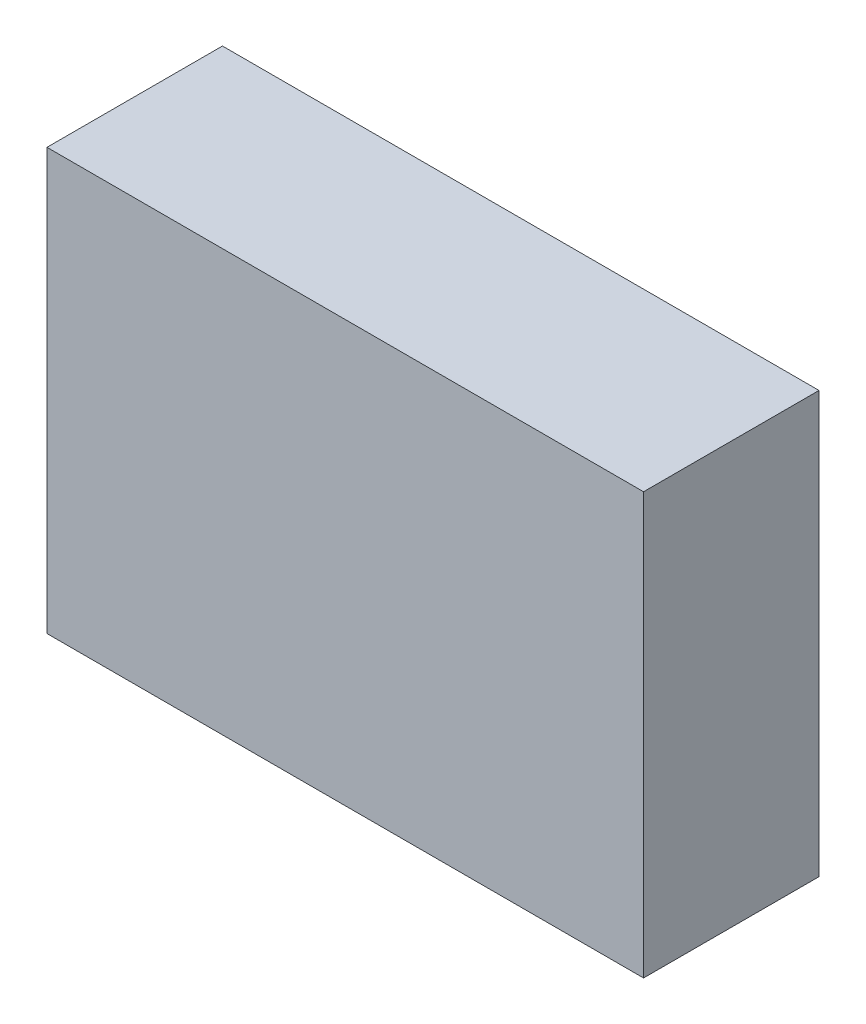
ISO-10303-21;
HEADER;
FILE_DESCRIPTION(('STEP AP214'),'2;1');
FILE_NAME('part.step','',(''),(''),'','','');
FILE_SCHEMA(('AUTOMOTIVE_DESIGN { 1 0 10303 214 1 1 1 1 }'));
ENDSEC;
DATA;
#1=APPLICATION_CONTEXT('core data for automotive mechanical design processes');
#2=APPLICATION_PROTOCOL_DEFINITION('international standard','automotive_design',2000,#1);
#3=PRODUCT_CONTEXT('',#1,'mechanical');
#4=PRODUCT('Part','Part','',(#3));
#5=PRODUCT_RELATED_PRODUCT_CATEGORY('part','',(#4));
#6=PRODUCT_DEFINITION_FORMATION('','',#4);
#7=PRODUCT_DEFINITION_CONTEXT('part definition',#1,'design');
#8=PRODUCT_DEFINITION('design','',#6,#7);
#9=PRODUCT_DEFINITION_SHAPE('','',#8);
#10=(LENGTH_UNIT() NAMED_UNIT(*) SI_UNIT(.MILLI.,.METRE.));
#11=(NAMED_UNIT(*) PLANE_ANGLE_UNIT() SI_UNIT($,.RADIAN.));
#12=(NAMED_UNIT(*) SI_UNIT($,.STERADIAN.) SOLID_ANGLE_UNIT());
#13=UNCERTAINTY_MEASURE_WITH_UNIT(LENGTH_MEASURE(1.E-05),#10,'distance_accuracy_value','');
#14=(GEOMETRIC_REPRESENTATION_CONTEXT(3) GLOBAL_UNCERTAINTY_ASSIGNED_CONTEXT((#13)) GLOBAL_UNIT_ASSIGNED_CONTEXT((#10,
#11,#12)) REPRESENTATION_CONTEXT('',''));
#15=CARTESIAN_POINT('',(0.,0.,0.));
#16=DIRECTION('',(0.,0.,1.));
#17=DIRECTION('',(1.,0.,0.));
#18=AXIS2_PLACEMENT_3D('',#15,#16,#17);
#19=CARTESIAN_POINT('',(-2.92,0.13,0.));
#20=DIRECTION('',(1.,0.,0.));
#21=DIRECTION('',(0.,0.,1.));
#22=AXIS2_PLACEMENT_3D('',#19,#20,#21);
#23=PLANE('',#22);
#24=DIRECTION('',(0.,1.,0.));
#25=VECTOR('',#24,1.);
#26=CARTESIAN_POINT('',(-2.92,0.13,0.1));
#27=LINE('',#26,#25);
#28=CARTESIAN_POINT('',(-2.92,0.13,0.1));
#29=VERTEX_POINT('',#28);
#30=CARTESIAN_POINT('',(-2.92,0.37,0.1));
#31=VERTEX_POINT('',#30);
#32=EDGE_CURVE('E11',#29,#31,#27,.T.);
#33=ORIENTED_EDGE('',*,*,#32,.T.);
#34=DIRECTION('',(0.,0.,1.));
#35=VECTOR('',#34,1.);
#36=CARTESIAN_POINT('',(-2.92,0.37,0.));
#37=LINE('',#36,#35);
#38=CARTESIAN_POINT('',(-2.92,0.37,0.));
#39=VERTEX_POINT('',#38);
#40=EDGE_CURVE('E24',#39,#31,#37,.T.);
#41=ORIENTED_EDGE('',*,*,#40,.F.);
#42=DIRECTION('',(0.,1.,0.));
#43=VECTOR('',#42,1.);
#44=CARTESIAN_POINT('',(-2.92,0.13,0.));
#45=LINE('',#44,#43);
#46=CARTESIAN_POINT('',(-2.92,0.13,0.));
#47=VERTEX_POINT('',#46);
#48=EDGE_CURVE('E86',#47,#39,#45,.T.);
#49=ORIENTED_EDGE('',*,*,#48,.F.);
#50=DIRECTION('',(0.,0.,1.));
#51=VECTOR('',#50,1.);
#52=CARTESIAN_POINT('',(-2.92,0.13,0.));
#53=LINE('',#52,#51);
#54=EDGE_CURVE('E36',#47,#29,#53,.T.);
#55=ORIENTED_EDGE('',*,*,#54,.T.);
#56=EDGE_LOOP('',(#33,#41,#49,#55));
#57=FACE_BOUND('',#56,.T.);
#58=ADVANCED_FACE('F17',(#57),#23,.F.);
#59=CARTESIAN_POINT('',(-2.58,0.13,0.));
#60=DIRECTION('',(1.,0.,0.));
#61=DIRECTION('',(0.,0.,1.));
#62=AXIS2_PLACEMENT_3D('',#59,#60,#61);
#63=PLANE('',#62);
#64=DIRECTION('',(0.,0.,1.));
#65=VECTOR('',#64,1.);
#66=CARTESIAN_POINT('',(-2.58,0.13,0.));
#67=LINE('',#66,#65);
#68=CARTESIAN_POINT('',(-2.58,0.13,0.));
#69=VERTEX_POINT('',#68);
#70=CARTESIAN_POINT('',(-2.58,0.13,0.1));
#71=VERTEX_POINT('',#70);
#72=EDGE_CURVE('E83',#69,#71,#67,.T.);
#73=ORIENTED_EDGE('',*,*,#72,.F.);
#74=DIRECTION('',(0.,1.,0.));
#75=VECTOR('',#74,1.);
#76=CARTESIAN_POINT('',(-2.58,0.13,0.));
#77=LINE('',#76,#75);
#78=CARTESIAN_POINT('',(-2.58,0.37,0.));
#79=VERTEX_POINT('',#78);
#80=EDGE_CURVE('E63',#69,#79,#77,.T.);
#81=ORIENTED_EDGE('',*,*,#80,.T.);
#82=DIRECTION('',(0.,0.,1.));
#83=VECTOR('',#82,1.);
#84=CARTESIAN_POINT('',(-2.58,0.37,0.));
#85=LINE('',#84,#83);
#86=CARTESIAN_POINT('',(-2.58,0.37,0.1));
#87=VERTEX_POINT('',#86);
#88=EDGE_CURVE('E57',#79,#87,#85,.T.);
#89=ORIENTED_EDGE('',*,*,#88,.T.);
#90=DIRECTION('',(0.,1.,0.));
#91=VECTOR('',#90,1.);
#92=CARTESIAN_POINT('',(-2.58,0.13,0.1));
#93=LINE('',#92,#91);
#94=EDGE_CURVE('E60',#71,#87,#93,.T.);
#95=ORIENTED_EDGE('',*,*,#94,.F.);
#96=EDGE_LOOP('',(#73,#81,#89,#95));
#97=FACE_BOUND('',#96,.T.);
#98=ADVANCED_FACE('F59',(#97),#63,.T.);
#99=CARTESIAN_POINT('',(-2.92,0.13,0.));
#100=DIRECTION('',(0.,1.,0.));
#101=DIRECTION('',(0.,0.,1.));
#102=AXIS2_PLACEMENT_3D('',#99,#100,#101);
#103=PLANE('',#102);
#104=ORIENTED_EDGE('',*,*,#72,.T.);
#105=DIRECTION('',(1.,0.,0.));
#106=VECTOR('',#105,1.);
#107=CARTESIAN_POINT('',(-2.92,0.13,0.1));
#108=LINE('',#107,#106);
#109=EDGE_CURVE('E71',#29,#71,#108,.T.);
#110=ORIENTED_EDGE('',*,*,#109,.F.);
#111=ORIENTED_EDGE('',*,*,#54,.F.);
#112=DIRECTION('',(1.,0.,0.));
#113=VECTOR('',#112,1.);
#114=CARTESIAN_POINT('',(-2.92,0.13,0.));
#115=LINE('',#114,#113);
#116=EDGE_CURVE('E76',#47,#69,#115,.T.);
#117=ORIENTED_EDGE('',*,*,#116,.T.);
#118=EDGE_LOOP('',(#104,#110,#111,#117));
#119=FACE_BOUND('',#118,.T.);
#120=ADVANCED_FACE('F91',(#119),#103,.F.);
#121=CARTESIAN_POINT('',(-2.92,0.37,0.));
#122=DIRECTION('',(0.,1.,0.));
#123=DIRECTION('',(0.,0.,1.));
#124=AXIS2_PLACEMENT_3D('',#121,#122,#123);
#125=PLANE('',#124);
#126=DIRECTION('',(1.,0.,0.));
#127=VECTOR('',#126,1.);
#128=CARTESIAN_POINT('',(-2.92,0.37,0.));
#129=LINE('',#128,#127);
#130=EDGE_CURVE('E74',#39,#79,#129,.T.);
#131=ORIENTED_EDGE('',*,*,#130,.F.);
#132=ORIENTED_EDGE('',*,*,#40,.T.);
#133=DIRECTION('',(1.,0.,0.));
#134=VECTOR('',#133,1.);
#135=CARTESIAN_POINT('',(-2.92,0.37,0.1));
#136=LINE('',#135,#134);
#137=EDGE_CURVE('E69',#31,#87,#136,.T.);
#138=ORIENTED_EDGE('',*,*,#137,.T.);
#139=ORIENTED_EDGE('',*,*,#88,.F.);
#140=EDGE_LOOP('',(#131,#132,#138,#139));
#141=FACE_BOUND('',#140,.T.);
#142=ADVANCED_FACE('F73',(#141),#125,.T.);
#143=CARTESIAN_POINT('',(-2.92,0.13,0.));
#144=DIRECTION('',(0.,0.,1.));
#145=DIRECTION('',(1.,0.,0.));
#146=AXIS2_PLACEMENT_3D('',#143,#144,#145);
#147=PLANE('',#146);
#148=ORIENTED_EDGE('',*,*,#130,.T.);
#149=ORIENTED_EDGE('',*,*,#80,.F.);
#150=ORIENTED_EDGE('',*,*,#116,.F.);
#151=ORIENTED_EDGE('',*,*,#48,.T.);
#152=EDGE_LOOP('',(#148,#149,#150,#151));
#153=FACE_BOUND('',#152,.T.);
#154=ADVANCED_FACE('F89',(#153),#147,.F.);
#155=CARTESIAN_POINT('',(-2.92,0.13,0.1));
#156=DIRECTION('',(0.,0.,1.));
#157=DIRECTION('',(1.,0.,0.));
#158=AXIS2_PLACEMENT_3D('',#155,#156,#157);
#159=PLANE('',#158);
#160=ORIENTED_EDGE('',*,*,#32,.F.);
#161=ORIENTED_EDGE('',*,*,#109,.T.);
#162=ORIENTED_EDGE('',*,*,#94,.T.);
#163=ORIENTED_EDGE('',*,*,#137,.F.);
#164=EDGE_LOOP('',(#160,#161,#162,#163));
#165=FACE_BOUND('',#164,.T.);
#166=ADVANCED_FACE('F68',(#165),#159,.T.);
#167=CLOSED_SHELL('',(#58,#98,#120,#142,#154,#166));
#168=MANIFOLD_SOLID_BREP('B1',#167);
#169=ADVANCED_BREP_SHAPE_REPRESENTATION('',(#18,#168),#14);
#170=SHAPE_DEFINITION_REPRESENTATION(#9,#169);
ENDSEC;
END-ISO-10303-21;
